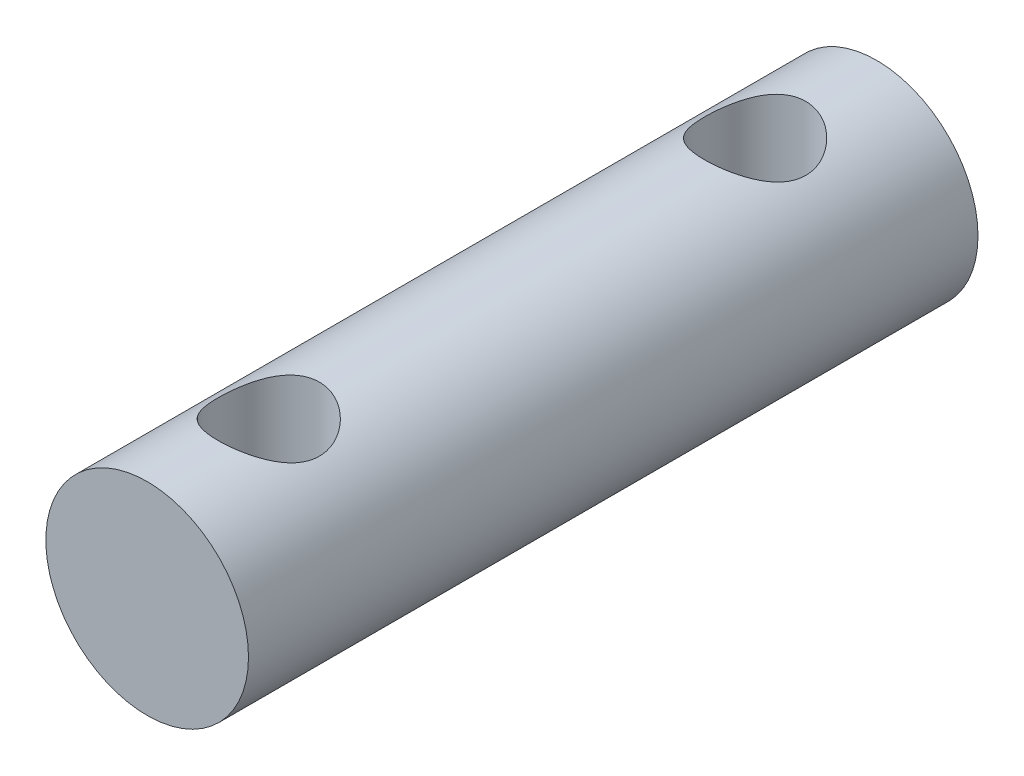
ISO-10303-21;
HEADER;
FILE_DESCRIPTION(('STEP AP214'),'2;1');
FILE_NAME('part.step','',(''),(''),'','','');
FILE_SCHEMA(('AUTOMOTIVE_DESIGN { 1 0 10303 214 1 1 1 1 }'));
ENDSEC;
DATA;
#1=APPLICATION_CONTEXT('core data for automotive mechanical design processes');
#2=APPLICATION_PROTOCOL_DEFINITION('international standard','automotive_design',2000,#1);
#3=PRODUCT_CONTEXT('',#1,'mechanical');
#4=PRODUCT('Part','Part','',(#3));
#5=PRODUCT_RELATED_PRODUCT_CATEGORY('part','',(#4));
#6=PRODUCT_DEFINITION_FORMATION('','',#4);
#7=PRODUCT_DEFINITION_CONTEXT('part definition',#1,'design');
#8=PRODUCT_DEFINITION('design','',#6,#7);
#9=PRODUCT_DEFINITION_SHAPE('','',#8);
#10=(LENGTH_UNIT() NAMED_UNIT(*) SI_UNIT(.MILLI.,.METRE.));
#11=(NAMED_UNIT(*) PLANE_ANGLE_UNIT() SI_UNIT($,.RADIAN.));
#12=(NAMED_UNIT(*) SI_UNIT($,.STERADIAN.) SOLID_ANGLE_UNIT());
#13=UNCERTAINTY_MEASURE_WITH_UNIT(LENGTH_MEASURE(1.E-05),#10,'distance_accuracy_value','');
#14=(GEOMETRIC_REPRESENTATION_CONTEXT(3) GLOBAL_UNCERTAINTY_ASSIGNED_CONTEXT((#13)) GLOBAL_UNIT_ASSIGNED_CONTEXT((#10,
#11,#12)) REPRESENTATION_CONTEXT('',''));
#15=CARTESIAN_POINT('',(0.,0.,0.));
#16=DIRECTION('',(0.,0.,1.));
#17=DIRECTION('',(1.,0.,0.));
#18=AXIS2_PLACEMENT_3D('',#15,#16,#17);
#19=CARTESIAN_POINT('',(0.,0.,18.));
#20=DIRECTION('',(0.,0.,-1.));
#21=DIRECTION('',(-1.,0.,0.));
#22=AXIS2_PLACEMENT_3D('',#19,#20,#21);
#23=CYLINDRICAL_SURFACE('',#22,2.5);
#24=CARTESIAN_POINT('',(0.,-2.5,4.25));
#25=CARTESIAN_POINT('',(0.0657149536912331,-2.49999641755188,4.24999587210062));
#26=CARTESIAN_POINT('',(0.131508249622541,-2.49738113774397,4.24478740859791));
#27=CARTESIAN_POINT('',(0.261150294085531,-2.48717695046745,4.22418389957385));
#28=CARTESIAN_POINT('',(0.32499510839188,-2.47957859786229,4.20876950875294));
#29=CARTESIAN_POINT('',(0.448666931100718,-2.46020349254139,4.16850773922901));
#30=CARTESIAN_POINT('',(0.508508503673975,-2.448442989719,4.14369701968999));
#31=CARTESIAN_POINT('',(0.623090771008206,-2.42182220644723,4.08553672329382));
#32=CARTESIAN_POINT('',(0.677831867487562,-2.40696217041912,4.05218781968893));
#33=CARTESIAN_POINT('',(0.784384772202399,-2.37445322822571,3.97560343814338));
#34=CARTESIAN_POINT('',(0.83581901390264,-2.3566899890942,3.93189190095045));
#35=CARTESIAN_POINT('',(0.930974306083722,-2.3207496280843,3.83684815094121));
#36=CARTESIAN_POINT('',(0.974689478883458,-2.30257220261294,3.78551018528445));
#37=CARTESIAN_POINT('',(1.05656500056285,-2.26623688996684,3.67189581309577));
#38=CARTESIAN_POINT('',(1.09403166943955,-2.24818983712665,3.60907987706761));
#39=CARTESIAN_POINT('',(1.15771028361337,-2.21607473465401,3.47704083001723));
#40=CARTESIAN_POINT('',(1.18393026870792,-2.20200384508737,3.40782233909656));
#41=CARTESIAN_POINT('',(1.22266555273574,-2.1807233379726,3.2691686182226));
#42=CARTESIAN_POINT('',(1.23590732135055,-2.17315339479642,3.19999443491576));
#43=CARTESIAN_POINT('',(1.25053374163606,-2.16477362435659,3.06002645277565));
#44=CARTESIAN_POINT('',(1.25193011046634,-2.1639571167911,2.98923432391106));
#45=CARTESIAN_POINT('',(1.24335910896537,-2.1688866282156,2.85714246960579));
#46=CARTESIAN_POINT('',(1.23473069942103,-2.17385954577517,2.79571996097119));
#47=CARTESIAN_POINT('',(1.20867481132117,-2.18845285917313,2.6753476132837));
#48=CARTESIAN_POINT('',(1.19124452987206,-2.1980747353972,2.61639856836836));
#49=CARTESIAN_POINT('',(1.1477622254825,-2.22109345515926,2.50096358429293));
#50=CARTESIAN_POINT('',(1.12151883389499,-2.23457300829998,2.44456700151776));
#51=CARTESIAN_POINT('',(1.061302109585,-2.26379255351754,2.33670713426249));
#52=CARTESIAN_POINT('',(1.02732530476558,-2.27953355975238,2.28524608049989));
#53=CARTESIAN_POINT('',(0.947582568640986,-2.31391447379107,2.18184843407097));
#54=CARTESIAN_POINT('',(0.900868072961602,-2.33266887795933,2.1306789080298));
#55=CARTESIAN_POINT('',(0.799444473426717,-2.36934529125509,2.03658072676137));
#56=CARTESIAN_POINT('',(0.744731570717857,-2.38726689948501,1.99365600995765));
#57=CARTESIAN_POINT('',(0.625645632289811,-2.42127484103705,1.91539292371284));
#58=CARTESIAN_POINT('',(0.560941989499261,-2.43723730202509,1.88049940944282));
#59=CARTESIAN_POINT('',(0.425582769360996,-2.46447351401553,1.82237871369624));
#60=CARTESIAN_POINT('',(0.354931970331596,-2.47575098679441,1.79914226873104));
#61=CARTESIAN_POINT('',(0.215958114575877,-2.49155417176795,1.76690574535416));
#62=CARTESIAN_POINT('',(0.147926913185405,-2.49656172876639,1.75688595531653));
#63=CARTESIAN_POINT('',(0.0109744999366919,-2.50091266823877,1.74816908608189));
#64=CARTESIAN_POINT('',(-0.0579462748373768,-2.5002587340164,1.74946664295065));
#65=CARTESIAN_POINT('',(-0.189041214982492,-2.49363990316801,1.76275836052344));
#66=CARTESIAN_POINT('',(-0.251324260062442,-2.48809057110237,1.77391566591254));
#67=CARTESIAN_POINT('',(-0.373008615377396,-2.47277714143524,1.80529758986886));
#68=CARTESIAN_POINT('',(-0.432409607113746,-2.46301257917915,1.8255232080667));
#69=CARTESIAN_POINT('',(-0.548610760562082,-2.43980314267087,1.87499808304146));
#70=CARTESIAN_POINT('',(-0.605287996257692,-2.42626102212424,1.90448881264602));
#71=CARTESIAN_POINT('',(-0.713076702123651,-2.39679967896386,1.97138441955755));
#72=CARTESIAN_POINT('',(-0.764185787219103,-2.38087944457231,2.00879266824179));
#73=CARTESIAN_POINT('',(-0.864709611613317,-2.3463527667183,2.09470053166609));
#74=CARTESIAN_POINT('',(-0.913465097280799,-2.32763606060551,2.14392858556696));
#75=CARTESIAN_POINT('',(-1.00232040139155,-2.29077989504843,2.24990643908663));
#76=CARTESIAN_POINT('',(-1.04241423211355,-2.27264084226908,2.30666139852047));
#77=CARTESIAN_POINT('',(-1.11463489312212,-2.23813990282585,2.42955456775039));
#78=CARTESIAN_POINT('',(-1.1462818698483,-2.2219066207934,2.49601408276074));
#79=CARTESIAN_POINT('',(-1.19760353251725,-2.19467590460158,2.63438758461565));
#80=CARTESIAN_POINT('',(-1.21729364485946,-2.18367172800772,2.70629440812648));
#81=CARTESIAN_POINT('',(-1.2423271093121,-2.16951876260833,2.84613777857681));
#82=CARTESIAN_POINT('',(-1.24886624550108,-2.16571729325614,2.91379281678629));
#83=CARTESIAN_POINT('',(-1.25086144297598,-2.16456693307719,3.04930883396341));
#84=CARTESIAN_POINT('',(-1.2463223082805,-2.16721524534441,3.11716971092429));
#85=CARTESIAN_POINT('',(-1.22740765699033,-2.17797327562531,3.24435437691502));
#86=CARTESIAN_POINT('',(-1.2140103929285,-2.18553868102992,3.3038755876805));
#87=CARTESIAN_POINT('',(-1.17896919778081,-2.20463770234897,3.41976014928088));
#88=CARTESIAN_POINT('',(-1.15732261394976,-2.21617259462094,3.47612247761496));
#89=CARTESIAN_POINT('',(-1.10476968162585,-2.2428566295566,3.58828106373326));
#90=CARTESIAN_POINT('',(-1.07333892227057,-2.25819652995238,3.64378487728713));
#91=CARTESIAN_POINT('',(-1.00268871454579,-2.29044164543238,3.74909317022573));
#92=CARTESIAN_POINT('',(-0.96346521404831,-2.30734767243152,3.79889466314811));
#93=CARTESIAN_POINT('',(-0.872754158330802,-2.34327903949141,3.89767747794702));
#94=CARTESIAN_POINT('',(-0.820355528762714,-2.36231229139336,3.9458238779524));
#95=CARTESIAN_POINT('',(-0.70769350777535,-2.39847190318859,4.03282872927954));
#96=CARTESIAN_POINT('',(-0.647425904070982,-2.4155972326005,4.07168217428286));
#97=CARTESIAN_POINT('',(-0.519914496024934,-2.44622511981379,4.13904545345276));
#98=CARTESIAN_POINT('',(-0.452624379918268,-2.45970120703636,4.16748021176429));
#99=CARTESIAN_POINT('',(-0.313427626617739,-2.48126676704332,4.21226020989869));
#100=CARTESIAN_POINT('',(-0.241534749528958,-2.48937154216165,4.22863980853697));
#101=CARTESIAN_POINT('',(-0.14075243310423,-2.49619327387079,4.24237176384481));
#102=CARTESIAN_POINT('',(-0.112702349299373,-2.49761706674002,4.24522830107952));
#103=CARTESIAN_POINT('',(-0.056439664758947,-2.49952121222331,4.24904333189601));
#104=CARTESIAN_POINT('',(-0.0282270595592267,-2.50000153879704,4.250001773089));
#105=CARTESIAN_POINT('',(0.,-2.5,4.25));
#106=B_SPLINE_CURVE_WITH_KNOTS('',3,(#24,#25,#26,#27,#28,#29,#30,#31,#32,#33,#34,#35,#36,#37,
#38,#39,#40,#41,#42,#43,#44,#45,#46,#47,#48,#49,#50,#51,#52,#53,#54,#55,#56,#57,#58,#59,#60,#61,
#62,#63,#64,#65,#66,#67,#68,#69,#70,#71,#72,#73,#74,#75,#76,#77,#78,#79,#80,#81,#82,#83,#84,#85,
#86,#87,#88,#89,#90,#91,#92,#93,#94,#95,#96,#97,#98,#99,#100,#101,#102,#103,#104,#105),
.UNSPECIFIED.,.T.,.F.,(4,2,2,2,2,2,2,2,2,2,2,2,2,2,2,2,2,2,2,2,2,2,2,2,2,2,2,2,2,2,2,2,2,2,2,2,
2,2,2,2,4),(0.,0.197030321775366,0.394435187136497,0.591077694365373,0.78770470072696,
0.996227198397612,1.20490779706754,1.42977158038441,1.65447434872851,1.86572515175287,
2.07676696661276,2.26257140511651,2.44843504907098,2.63862800210609,2.82890651575277,
3.04331176667348,3.25781918248358,3.48228777768051,3.7065777114035,3.91229113089182,
4.11790705639345,4.30758633132653,4.49728652038664,4.69241070034873,4.88761813435424,
5.10199513305524,5.3165198576929,5.54143352699593,5.76605639925972,5.96911634372967,
6.17208824825007,6.35572412805228,6.53941910979598,6.73545570969518,6.93159451423697,
7.15156553440623,7.37165479220716,7.59330017078656,7.81431135781163,7.89894100172122,
7.98357298143559),.UNSPECIFIED.);
#107=CARTESIAN_POINT('',(0.,-2.5,4.25));
#108=VERTEX_POINT('',#107);
#109=EDGE_CURVE('E10',#108,#108,#106,.T.);
#110=ORIENTED_EDGE('',*,*,#109,.T.);
#111=EDGE_LOOP('',(#110));
#112=FACE_BOUND('',#111,.T.);
#113=CARTESIAN_POINT('',(0.,2.5,4.25));
#114=CARTESIAN_POINT('',(-0.0657149536912331,2.49999641755188,4.24999587210062));
#115=CARTESIAN_POINT('',(-0.131508249622541,2.49738113774397,4.24478740859791));
#116=CARTESIAN_POINT('',(-0.261150294085531,2.48717695046745,4.22418389957385));
#117=CARTESIAN_POINT('',(-0.32499510839188,2.47957859786229,4.20876950875294));
#118=CARTESIAN_POINT('',(-0.448666931100718,2.46020349254139,4.16850773922901));
#119=CARTESIAN_POINT('',(-0.508508503673975,2.448442989719,4.14369701968999));
#120=CARTESIAN_POINT('',(-0.623090771008206,2.42182220644723,4.08553672329382));
#121=CARTESIAN_POINT('',(-0.677831867487562,2.40696217041912,4.05218781968893));
#122=CARTESIAN_POINT('',(-0.784384772202399,2.37445322822571,3.97560343814338));
#123=CARTESIAN_POINT('',(-0.83581901390264,2.3566899890942,3.93189190095045));
#124=CARTESIAN_POINT('',(-0.930974306083722,2.3207496280843,3.83684815094121));
#125=CARTESIAN_POINT('',(-0.974689478883458,2.30257220261294,3.78551018528445));
#126=CARTESIAN_POINT('',(-1.05656500056285,2.26623688996684,3.67189581309577));
#127=CARTESIAN_POINT('',(-1.09403166943955,2.24818983712665,3.60907987706761));
#128=CARTESIAN_POINT('',(-1.15771028361337,2.21607473465401,3.47704083001723));
#129=CARTESIAN_POINT('',(-1.18393026870792,2.20200384508737,3.40782233909656));
#130=CARTESIAN_POINT('',(-1.22266555273574,2.1807233379726,3.2691686182226));
#131=CARTESIAN_POINT('',(-1.23590732135055,2.17315339479642,3.19999443491576));
#132=CARTESIAN_POINT('',(-1.25053374163606,2.16477362435659,3.06002645277565));
#133=CARTESIAN_POINT('',(-1.25193011046634,2.1639571167911,2.98923432391106));
#134=CARTESIAN_POINT('',(-1.24335910896537,2.1688866282156,2.85714246960579));
#135=CARTESIAN_POINT('',(-1.23473069942103,2.17385954577517,2.79571996097119));
#136=CARTESIAN_POINT('',(-1.20867481132117,2.18845285917313,2.6753476132837));
#137=CARTESIAN_POINT('',(-1.19124452987206,2.1980747353972,2.61639856836836));
#138=CARTESIAN_POINT('',(-1.1477622254825,2.22109345515926,2.50096358429293));
#139=CARTESIAN_POINT('',(-1.12151883389499,2.23457300829998,2.44456700151776));
#140=CARTESIAN_POINT('',(-1.061302109585,2.26379255351754,2.33670713426249));
#141=CARTESIAN_POINT('',(-1.02732530476558,2.27953355975238,2.28524608049989));
#142=CARTESIAN_POINT('',(-0.947582568640986,2.31391447379107,2.18184843407097));
#143=CARTESIAN_POINT('',(-0.900868072961602,2.33266887795933,2.1306789080298));
#144=CARTESIAN_POINT('',(-0.799444473426717,2.36934529125509,2.03658072676137));
#145=CARTESIAN_POINT('',(-0.744731570717857,2.38726689948501,1.99365600995765));
#146=CARTESIAN_POINT('',(-0.625645632289811,2.42127484103705,1.91539292371284));
#147=CARTESIAN_POINT('',(-0.560941989499261,2.43723730202509,1.88049940944282));
#148=CARTESIAN_POINT('',(-0.425582769360996,2.46447351401553,1.82237871369624));
#149=CARTESIAN_POINT('',(-0.354931970331596,2.47575098679441,1.79914226873104));
#150=CARTESIAN_POINT('',(-0.215958114575877,2.49155417176795,1.76690574535416));
#151=CARTESIAN_POINT('',(-0.147926913185405,2.49656172876639,1.75688595531653));
#152=CARTESIAN_POINT('',(-0.0109744999366919,2.50091266823877,1.74816908608189));
#153=CARTESIAN_POINT('',(0.0579462748373768,2.5002587340164,1.74946664295065));
#154=CARTESIAN_POINT('',(0.189041214982492,2.49363990316801,1.76275836052344));
#155=CARTESIAN_POINT('',(0.251324260062442,2.48809057110237,1.77391566591254));
#156=CARTESIAN_POINT('',(0.373008615377396,2.47277714143524,1.80529758986886));
#157=CARTESIAN_POINT('',(0.432409607113746,2.46301257917915,1.8255232080667));
#158=CARTESIAN_POINT('',(0.548610760562082,2.43980314267087,1.87499808304146));
#159=CARTESIAN_POINT('',(0.605287996257692,2.42626102212424,1.90448881264602));
#160=CARTESIAN_POINT('',(0.713076702123651,2.39679967896386,1.97138441955755));
#161=CARTESIAN_POINT('',(0.764185787219103,2.38087944457231,2.00879266824179));
#162=CARTESIAN_POINT('',(0.864709611613317,2.3463527667183,2.09470053166609));
#163=CARTESIAN_POINT('',(0.913465097280799,2.32763606060551,2.14392858556696));
#164=CARTESIAN_POINT('',(1.00232040139155,2.29077989504843,2.24990643908663));
#165=CARTESIAN_POINT('',(1.04241423211355,2.27264084226908,2.30666139852047));
#166=CARTESIAN_POINT('',(1.11463489312212,2.23813990282585,2.42955456775039));
#167=CARTESIAN_POINT('',(1.1462818698483,2.2219066207934,2.49601408276074));
#168=CARTESIAN_POINT('',(1.19760353251725,2.19467590460158,2.63438758461565));
#169=CARTESIAN_POINT('',(1.21729364485946,2.18367172800772,2.70629440812648));
#170=CARTESIAN_POINT('',(1.2423271093121,2.16951876260833,2.84613777857681));
#171=CARTESIAN_POINT('',(1.24886624550108,2.16571729325614,2.91379281678629));
#172=CARTESIAN_POINT('',(1.25086144297598,2.16456693307719,3.04930883396341));
#173=CARTESIAN_POINT('',(1.2463223082805,2.16721524534441,3.11716971092429));
#174=CARTESIAN_POINT('',(1.22740765699033,2.17797327562531,3.24435437691502));
#175=CARTESIAN_POINT('',(1.2140103929285,2.18553868102992,3.3038755876805));
#176=CARTESIAN_POINT('',(1.17896919778081,2.20463770234897,3.41976014928088));
#177=CARTESIAN_POINT('',(1.15732261394976,2.21617259462094,3.47612247761496));
#178=CARTESIAN_POINT('',(1.10476968162585,2.2428566295566,3.58828106373326));
#179=CARTESIAN_POINT('',(1.07333892227057,2.25819652995238,3.64378487728713));
#180=CARTESIAN_POINT('',(1.00268871454579,2.29044164543238,3.74909317022573));
#181=CARTESIAN_POINT('',(0.96346521404831,2.30734767243152,3.79889466314811));
#182=CARTESIAN_POINT('',(0.872754158330802,2.34327903949141,3.89767747794702));
#183=CARTESIAN_POINT('',(0.820355528762714,2.36231229139336,3.9458238779524));
#184=CARTESIAN_POINT('',(0.70769350777535,2.39847190318859,4.03282872927954));
#185=CARTESIAN_POINT('',(0.647425904070982,2.4155972326005,4.07168217428286));
#186=CARTESIAN_POINT('',(0.519914496024934,2.44622511981379,4.13904545345276));
#187=CARTESIAN_POINT('',(0.452624379918268,2.45970120703636,4.16748021176429));
#188=CARTESIAN_POINT('',(0.313427626617739,2.48126676704332,4.21226020989869));
#189=CARTESIAN_POINT('',(0.241534749528958,2.48937154216165,4.22863980853697));
#190=CARTESIAN_POINT('',(0.14075243310423,2.49619327387079,4.24237176384481));
#191=CARTESIAN_POINT('',(0.112702349299373,2.49761706674002,4.24522830107952));
#192=CARTESIAN_POINT('',(0.056439664758947,2.49952121222331,4.24904333189601));
#193=CARTESIAN_POINT('',(0.0282270595592267,2.50000153879704,4.250001773089));
#194=CARTESIAN_POINT('',(0.,2.5,4.25));
#195=B_SPLINE_CURVE_WITH_KNOTS('',3,(#113,#114,#115,#116,#117,#118,#119,#120,#121,#122,#123,
#124,#125,#126,#127,#128,#129,#130,#131,#132,#133,#134,#135,#136,#137,#138,#139,#140,#141,#142,
#143,#144,#145,#146,#147,#148,#149,#150,#151,#152,#153,#154,#155,#156,#157,#158,#159,#160,#161,
#162,#163,#164,#165,#166,#167,#168,#169,#170,#171,#172,#173,#174,#175,#176,#177,#178,#179,#180,
#181,#182,#183,#184,#185,#186,#187,#188,#189,#190,#191,#192,#193,#194),.UNSPECIFIED.,.T.,.F.,(4,
2,2,2,2,2,2,2,2,2,2,2,2,2,2,2,2,2,2,2,2,2,2,2,2,2,2,2,2,2,2,2,2,2,2,2,2,2,2,2,4),(0.,
0.197030321775366,0.394435187136497,0.591077694365373,0.78770470072696,0.996227198397612,
1.20490779706754,1.42977158038441,1.65447434872851,1.86572515175287,2.07676696661276,
2.26257140511651,2.44843504907098,2.63862800210609,2.82890651575277,3.04331176667348,
3.25781918248358,3.48228777768051,3.7065777114035,3.91229113089182,4.11790705639345,
4.30758633132653,4.49728652038664,4.69241070034873,4.88761813435424,5.10199513305524,
5.3165198576929,5.54143352699593,5.76605639925972,5.96911634372967,6.17208824825007,
6.35572412805228,6.53941910979598,6.73545570969518,6.93159451423697,7.15156553440623,
7.37165479220716,7.59330017078656,7.81431135781163,7.89894100172122,7.98357298143559),.UNSPECIFIED.);
#196=CARTESIAN_POINT('',(0.,2.5,4.25));
#197=VERTEX_POINT('',#196);
#198=EDGE_CURVE('E55',#197,#197,#195,.T.);
#199=ORIENTED_EDGE('',*,*,#198,.T.);
#200=EDGE_LOOP('',(#199));
#201=FACE_BOUND('',#200,.T.);
#202=CARTESIAN_POINT('',(0.,-2.5,16.25));
#203=CARTESIAN_POINT('',(0.0657149536912331,-2.49999641755188,16.2499958721006));
#204=CARTESIAN_POINT('',(0.131508249622541,-2.49738113774397,16.2447874085979));
#205=CARTESIAN_POINT('',(0.261150294085531,-2.48717695046745,16.2241838995739));
#206=CARTESIAN_POINT('',(0.324995108391879,-2.47957859786229,16.2087695087529));
#207=CARTESIAN_POINT('',(0.448666931100718,-2.46020349254139,16.168507739229));
#208=CARTESIAN_POINT('',(0.508508503673975,-2.448442989719,16.14369701969));
#209=CARTESIAN_POINT('',(0.623090771008206,-2.42182220644723,16.0855367232938));
#210=CARTESIAN_POINT('',(0.677831867487562,-2.40696217041912,16.0521878196889));
#211=CARTESIAN_POINT('',(0.784384772202398,-2.37445322822571,15.9756034381434));
#212=CARTESIAN_POINT('',(0.835819013902639,-2.3566899890942,15.9318919009504));
#213=CARTESIAN_POINT('',(0.930974306083721,-2.3207496280843,15.8368481509412));
#214=CARTESIAN_POINT('',(0.974689478883458,-2.30257220261294,15.7855101852844));
#215=CARTESIAN_POINT('',(1.05656500056285,-2.26623688996684,15.6718958130958));
#216=CARTESIAN_POINT('',(1.09403166943955,-2.24818983712665,15.6090798770676));
#217=CARTESIAN_POINT('',(1.15771028361337,-2.21607473465401,15.4770408300172));
#218=CARTESIAN_POINT('',(1.18393026870792,-2.20200384508737,15.4078223390966));
#219=CARTESIAN_POINT('',(1.22266555273574,-2.1807233379726,15.2691686182226));
#220=CARTESIAN_POINT('',(1.23590732135055,-2.17315339479642,15.1999944349158));
#221=CARTESIAN_POINT('',(1.25053374163606,-2.16477362435659,15.0600264527757));
#222=CARTESIAN_POINT('',(1.25193011046634,-2.1639571167911,14.9892343239111));
#223=CARTESIAN_POINT('',(1.24335910896537,-2.1688866282156,14.8571424696058));
#224=CARTESIAN_POINT('',(1.23473069942103,-2.17385954577517,14.7957199609712));
#225=CARTESIAN_POINT('',(1.20867481132117,-2.18845285917313,14.6753476132837));
#226=CARTESIAN_POINT('',(1.19124452987207,-2.1980747353972,14.6163985683684));
#227=CARTESIAN_POINT('',(1.1477622254825,-2.22109345515926,14.5009635842929));
#228=CARTESIAN_POINT('',(1.12151883389499,-2.23457300829998,14.4445670015178));
#229=CARTESIAN_POINT('',(1.061302109585,-2.26379255351754,14.3367071342625));
#230=CARTESIAN_POINT('',(1.02732530476558,-2.27953355975238,14.2852460804999));
#231=CARTESIAN_POINT('',(0.947582568640985,-2.31391447379107,14.181848434071));
#232=CARTESIAN_POINT('',(0.900868072961601,-2.33266887795933,14.1306789080298));
#233=CARTESIAN_POINT('',(0.799444473426715,-2.36934529125509,14.0365807267614));
#234=CARTESIAN_POINT('',(0.744731570717856,-2.38726689948501,13.9936560099576));
#235=CARTESIAN_POINT('',(0.62564563228981,-2.42127484103705,13.9153929237128));
#236=CARTESIAN_POINT('',(0.56094198949926,-2.43723730202509,13.8804994094428));
#237=CARTESIAN_POINT('',(0.425582769360995,-2.46447351401553,13.8223787136962));
#238=CARTESIAN_POINT('',(0.354931970331595,-2.47575098679441,13.799142268731));
#239=CARTESIAN_POINT('',(0.215958114575876,-2.49155417176795,13.7669057453542));
#240=CARTESIAN_POINT('',(0.147926913185404,-2.49656172876639,13.7568859553165));
#241=CARTESIAN_POINT('',(0.0109744999366912,-2.50091266823877,13.7481690860819));
#242=CARTESIAN_POINT('',(-0.0579462748373774,-2.5002587340164,13.7494666429507));
#243=CARTESIAN_POINT('',(-0.189041214982492,-2.49363990316801,13.7627583605234));
#244=CARTESIAN_POINT('',(-0.251324260062442,-2.48809057110237,13.7739156659125));
#245=CARTESIAN_POINT('',(-0.373008615377396,-2.47277714143524,13.8052975898689));
#246=CARTESIAN_POINT('',(-0.432409607113746,-2.46301257917915,13.8255232080667));
#247=CARTESIAN_POINT('',(-0.548610760562082,-2.43980314267087,13.8749980830415));
#248=CARTESIAN_POINT('',(-0.605287996257693,-2.42626102212424,13.904488812646));
#249=CARTESIAN_POINT('',(-0.713076702123652,-2.39679967896386,13.9713844195576));
#250=CARTESIAN_POINT('',(-0.764185787219103,-2.38087944457231,14.0087926682418));
#251=CARTESIAN_POINT('',(-0.864709611613317,-2.3463527667183,14.0947005316661));
#252=CARTESIAN_POINT('',(-0.913465097280799,-2.32763606060551,14.143928585567));
#253=CARTESIAN_POINT('',(-1.00232040139155,-2.29077989504843,14.2499064390866));
#254=CARTESIAN_POINT('',(-1.04241423211355,-2.27264084226908,14.3066613985205));
#255=CARTESIAN_POINT('',(-1.11463489312212,-2.23813990282585,14.4295545677504));
#256=CARTESIAN_POINT('',(-1.1462818698483,-2.2219066207934,14.4960140827607));
#257=CARTESIAN_POINT('',(-1.19760353251725,-2.19467590460158,14.6343875846157));
#258=CARTESIAN_POINT('',(-1.21729364485946,-2.18367172800772,14.7062944081265));
#259=CARTESIAN_POINT('',(-1.2423271093121,-2.16951876260833,14.8461377785768));
#260=CARTESIAN_POINT('',(-1.24886624550108,-2.16571729325614,14.9137928167863));
#261=CARTESIAN_POINT('',(-1.25086144297598,-2.16456693307719,15.0493088339634));
#262=CARTESIAN_POINT('',(-1.2463223082805,-2.16721524534441,15.1171697109243));
#263=CARTESIAN_POINT('',(-1.22740765699033,-2.17797327562531,15.244354376915));
#264=CARTESIAN_POINT('',(-1.2140103929285,-2.18553868102992,15.3038755876805));
#265=CARTESIAN_POINT('',(-1.17896919778081,-2.20463770234897,15.4197601492809));
#266=CARTESIAN_POINT('',(-1.15732261394976,-2.21617259462094,15.476122477615));
#267=CARTESIAN_POINT('',(-1.10476968162585,-2.2428566295566,15.5882810637333));
#268=CARTESIAN_POINT('',(-1.07333892227057,-2.25819652995238,15.6437848772871));
#269=CARTESIAN_POINT('',(-1.00268871454579,-2.29044164543238,15.7490931702257));
#270=CARTESIAN_POINT('',(-0.96346521404831,-2.30734767243152,15.7988946631481));
#271=CARTESIAN_POINT('',(-0.8727541583308,-2.34327903949141,15.897677477947));
#272=CARTESIAN_POINT('',(-0.820355528762713,-2.36231229139336,15.9458238779524));
#273=CARTESIAN_POINT('',(-0.70769350777535,-2.39847190318859,16.0328287292795));
#274=CARTESIAN_POINT('',(-0.647425904070982,-2.4155972326005,16.0716821742829));
#275=CARTESIAN_POINT('',(-0.519914496024934,-2.44622511981379,16.1390454534528));
#276=CARTESIAN_POINT('',(-0.452624379918268,-2.45970120703636,16.1674802117643));
#277=CARTESIAN_POINT('',(-0.313427626617739,-2.48126676704332,16.2122602098987));
#278=CARTESIAN_POINT('',(-0.241534749528958,-2.48937154216165,16.228639808537));
#279=CARTESIAN_POINT('',(-0.14075243310423,-2.49619327387079,16.2423717638448));
#280=CARTESIAN_POINT('',(-0.112702349299374,-2.49761706674002,16.2452283010795));
#281=CARTESIAN_POINT('',(-0.0564396647589473,-2.49952121222331,16.249043331896));
#282=CARTESIAN_POINT('',(-0.0282270595592268,-2.50000153879704,16.250001773089));
#283=CARTESIAN_POINT('',(0.,-2.5,16.25));
#284=B_SPLINE_CURVE_WITH_KNOTS('',3,(#202,#203,#204,#205,#206,#207,#208,#209,#210,#211,#212,
#213,#214,#215,#216,#217,#218,#219,#220,#221,#222,#223,#224,#225,#226,#227,#228,#229,#230,#231,
#232,#233,#234,#235,#236,#237,#238,#239,#240,#241,#242,#243,#244,#245,#246,#247,#248,#249,#250,
#251,#252,#253,#254,#255,#256,#257,#258,#259,#260,#261,#262,#263,#264,#265,#266,#267,#268,#269,
#270,#271,#272,#273,#274,#275,#276,#277,#278,#279,#280,#281,#282,#283),.UNSPECIFIED.,.T.,.F.,(4,
2,2,2,2,2,2,2,2,2,2,2,2,2,2,2,2,2,2,2,2,2,2,2,2,2,2,2,2,2,2,2,2,2,2,2,2,2,2,2,4),(0.,
0.197030321775366,0.394435187136497,0.591077694365372,0.787704700726959,0.99622719839761,
1.20490779706754,1.42977158038441,1.65447434872851,1.86572515175287,2.07676696661275,
2.2625714051165,2.44843504907098,2.63862800210609,2.82890651575277,3.04331176667348,
3.25781918248358,3.48228777768051,3.7065777114035,3.91229113089182,4.11790705639345,
4.30758633132652,4.49728652038664,4.69241070034873,4.88761813435424,5.10199513305524,
5.3165198576929,5.54143352699592,5.76605639925972,5.96911634372967,6.17208824825007,
6.35572412805228,6.53941910979598,6.73545570969518,6.93159451423697,7.15156553440623,
7.37165479220716,7.59330017078656,7.81431135781163,7.89894100172122,7.98357298143558),.UNSPECIFIED.);
#285=CARTESIAN_POINT('',(0.,-2.5,16.25));
#286=VERTEX_POINT('',#285);
#287=EDGE_CURVE('E60',#286,#286,#284,.T.);
#288=ORIENTED_EDGE('',*,*,#287,.T.);
#289=EDGE_LOOP('',(#288));
#290=FACE_BOUND('',#289,.T.);
#291=CARTESIAN_POINT('',(0.,2.5,16.25));
#292=CARTESIAN_POINT('',(-0.0657149536912331,2.49999641755188,16.2499958721006));
#293=CARTESIAN_POINT('',(-0.131508249622541,2.49738113774397,16.2447874085979));
#294=CARTESIAN_POINT('',(-0.261150294085531,2.48717695046745,16.2241838995739));
#295=CARTESIAN_POINT('',(-0.324995108391879,2.47957859786229,16.2087695087529));
#296=CARTESIAN_POINT('',(-0.448666931100718,2.46020349254139,16.168507739229));
#297=CARTESIAN_POINT('',(-0.508508503673975,2.448442989719,16.14369701969));
#298=CARTESIAN_POINT('',(-0.623090771008206,2.42182220644723,16.0855367232938));
#299=CARTESIAN_POINT('',(-0.677831867487562,2.40696217041912,16.0521878196889));
#300=CARTESIAN_POINT('',(-0.784384772202398,2.37445322822571,15.9756034381434));
#301=CARTESIAN_POINT('',(-0.835819013902639,2.3566899890942,15.9318919009504));
#302=CARTESIAN_POINT('',(-0.930974306083721,2.3207496280843,15.8368481509412));
#303=CARTESIAN_POINT('',(-0.974689478883458,2.30257220261294,15.7855101852844));
#304=CARTESIAN_POINT('',(-1.05656500056285,2.26623688996684,15.6718958130958));
#305=CARTESIAN_POINT('',(-1.09403166943955,2.24818983712665,15.6090798770676));
#306=CARTESIAN_POINT('',(-1.15771028361337,2.21607473465401,15.4770408300172));
#307=CARTESIAN_POINT('',(-1.18393026870792,2.20200384508737,15.4078223390966));
#308=CARTESIAN_POINT('',(-1.22266555273574,2.1807233379726,15.2691686182226));
#309=CARTESIAN_POINT('',(-1.23590732135055,2.17315339479642,15.1999944349158));
#310=CARTESIAN_POINT('',(-1.25053374163606,2.16477362435659,15.0600264527757));
#311=CARTESIAN_POINT('',(-1.25193011046634,2.1639571167911,14.9892343239111));
#312=CARTESIAN_POINT('',(-1.24335910896537,2.1688866282156,14.8571424696058));
#313=CARTESIAN_POINT('',(-1.23473069942103,2.17385954577517,14.7957199609712));
#314=CARTESIAN_POINT('',(-1.20867481132117,2.18845285917313,14.6753476132837));
#315=CARTESIAN_POINT('',(-1.19124452987207,2.1980747353972,14.6163985683684));
#316=CARTESIAN_POINT('',(-1.1477622254825,2.22109345515926,14.5009635842929));
#317=CARTESIAN_POINT('',(-1.12151883389499,2.23457300829998,14.4445670015178));
#318=CARTESIAN_POINT('',(-1.061302109585,2.26379255351754,14.3367071342625));
#319=CARTESIAN_POINT('',(-1.02732530476558,2.27953355975238,14.2852460804999));
#320=CARTESIAN_POINT('',(-0.947582568640985,2.31391447379107,14.181848434071));
#321=CARTESIAN_POINT('',(-0.900868072961601,2.33266887795933,14.1306789080298));
#322=CARTESIAN_POINT('',(-0.799444473426715,2.36934529125509,14.0365807267614));
#323=CARTESIAN_POINT('',(-0.744731570717856,2.38726689948501,13.9936560099576));
#324=CARTESIAN_POINT('',(-0.62564563228981,2.42127484103705,13.9153929237128));
#325=CARTESIAN_POINT('',(-0.56094198949926,2.43723730202509,13.8804994094428));
#326=CARTESIAN_POINT('',(-0.425582769360995,2.46447351401553,13.8223787136962));
#327=CARTESIAN_POINT('',(-0.354931970331595,2.47575098679441,13.799142268731));
#328=CARTESIAN_POINT('',(-0.215958114575876,2.49155417176795,13.7669057453542));
#329=CARTESIAN_POINT('',(-0.147926913185404,2.49656172876639,13.7568859553165));
#330=CARTESIAN_POINT('',(-0.0109744999366912,2.50091266823877,13.7481690860819));
#331=CARTESIAN_POINT('',(0.0579462748373774,2.5002587340164,13.7494666429507));
#332=CARTESIAN_POINT('',(0.189041214982492,2.49363990316801,13.7627583605234));
#333=CARTESIAN_POINT('',(0.251324260062442,2.48809057110237,13.7739156659125));
#334=CARTESIAN_POINT('',(0.373008615377396,2.47277714143524,13.8052975898689));
#335=CARTESIAN_POINT('',(0.432409607113746,2.46301257917915,13.8255232080667));
#336=CARTESIAN_POINT('',(0.548610760562082,2.43980314267087,13.8749980830415));
#337=CARTESIAN_POINT('',(0.605287996257693,2.42626102212424,13.904488812646));
#338=CARTESIAN_POINT('',(0.713076702123652,2.39679967896386,13.9713844195576));
#339=CARTESIAN_POINT('',(0.764185787219103,2.38087944457231,14.0087926682418));
#340=CARTESIAN_POINT('',(0.864709611613317,2.3463527667183,14.0947005316661));
#341=CARTESIAN_POINT('',(0.913465097280799,2.32763606060551,14.143928585567));
#342=CARTESIAN_POINT('',(1.00232040139155,2.29077989504843,14.2499064390866));
#343=CARTESIAN_POINT('',(1.04241423211355,2.27264084226908,14.3066613985205));
#344=CARTESIAN_POINT('',(1.11463489312212,2.23813990282585,14.4295545677504));
#345=CARTESIAN_POINT('',(1.1462818698483,2.2219066207934,14.4960140827607));
#346=CARTESIAN_POINT('',(1.19760353251725,2.19467590460158,14.6343875846157));
#347=CARTESIAN_POINT('',(1.21729364485946,2.18367172800772,14.7062944081265));
#348=CARTESIAN_POINT('',(1.2423271093121,2.16951876260833,14.8461377785768));
#349=CARTESIAN_POINT('',(1.24886624550108,2.16571729325614,14.9137928167863));
#350=CARTESIAN_POINT('',(1.25086144297598,2.16456693307719,15.0493088339634));
#351=CARTESIAN_POINT('',(1.2463223082805,2.16721524534441,15.1171697109243));
#352=CARTESIAN_POINT('',(1.22740765699033,2.17797327562531,15.244354376915));
#353=CARTESIAN_POINT('',(1.2140103929285,2.18553868102992,15.3038755876805));
#354=CARTESIAN_POINT('',(1.17896919778081,2.20463770234897,15.4197601492809));
#355=CARTESIAN_POINT('',(1.15732261394976,2.21617259462094,15.476122477615));
#356=CARTESIAN_POINT('',(1.10476968162585,2.2428566295566,15.5882810637333));
#357=CARTESIAN_POINT('',(1.07333892227057,2.25819652995238,15.6437848772871));
#358=CARTESIAN_POINT('',(1.00268871454579,2.29044164543238,15.7490931702257));
#359=CARTESIAN_POINT('',(0.96346521404831,2.30734767243152,15.7988946631481));
#360=CARTESIAN_POINT('',(0.8727541583308,2.34327903949141,15.897677477947));
#361=CARTESIAN_POINT('',(0.820355528762713,2.36231229139336,15.9458238779524));
#362=CARTESIAN_POINT('',(0.70769350777535,2.39847190318859,16.0328287292795));
#363=CARTESIAN_POINT('',(0.647425904070982,2.4155972326005,16.0716821742829));
#364=CARTESIAN_POINT('',(0.519914496024934,2.44622511981379,16.1390454534528));
#365=CARTESIAN_POINT('',(0.452624379918268,2.45970120703636,16.1674802117643));
#366=CARTESIAN_POINT('',(0.313427626617739,2.48126676704332,16.2122602098987));
#367=CARTESIAN_POINT('',(0.241534749528958,2.48937154216165,16.228639808537));
#368=CARTESIAN_POINT('',(0.14075243310423,2.49619327387079,16.2423717638448));
#369=CARTESIAN_POINT('',(0.112702349299374,2.49761706674002,16.2452283010795));
#370=CARTESIAN_POINT('',(0.0564396647589473,2.49952121222331,16.249043331896));
#371=CARTESIAN_POINT('',(0.0282270595592268,2.50000153879704,16.250001773089));
#372=CARTESIAN_POINT('',(0.,2.5,16.25));
#373=B_SPLINE_CURVE_WITH_KNOTS('',3,(#291,#292,#293,#294,#295,#296,#297,#298,#299,#300,#301,
#302,#303,#304,#305,#306,#307,#308,#309,#310,#311,#312,#313,#314,#315,#316,#317,#318,#319,#320,
#321,#322,#323,#324,#325,#326,#327,#328,#329,#330,#331,#332,#333,#334,#335,#336,#337,#338,#339,
#340,#341,#342,#343,#344,#345,#346,#347,#348,#349,#350,#351,#352,#353,#354,#355,#356,#357,#358,
#359,#360,#361,#362,#363,#364,#365,#366,#367,#368,#369,#370,#371,#372),.UNSPECIFIED.,.T.,.F.,(4,
2,2,2,2,2,2,2,2,2,2,2,2,2,2,2,2,2,2,2,2,2,2,2,2,2,2,2,2,2,2,2,2,2,2,2,2,2,2,2,4),(0.,
0.197030321775366,0.394435187136497,0.591077694365372,0.787704700726959,0.99622719839761,
1.20490779706754,1.42977158038441,1.65447434872851,1.86572515175287,2.07676696661275,
2.2625714051165,2.44843504907098,2.63862800210609,2.82890651575277,3.04331176667348,
3.25781918248358,3.48228777768051,3.7065777114035,3.91229113089182,4.11790705639345,
4.30758633132652,4.49728652038664,4.69241070034873,4.88761813435424,5.10199513305524,
5.3165198576929,5.54143352699592,5.76605639925972,5.96911634372967,6.17208824825007,
6.35572412805228,6.53941910979598,6.73545570969518,6.93159451423697,7.15156553440623,
7.37165479220716,7.59330017078656,7.81431135781163,7.89894100172122,7.98357298143558),.UNSPECIFIED.);
#374=CARTESIAN_POINT('',(0.,2.5,16.25));
#375=VERTEX_POINT('',#374);
#376=EDGE_CURVE('E65',#375,#375,#373,.T.);
#377=ORIENTED_EDGE('',*,*,#376,.T.);
#378=EDGE_LOOP('',(#377));
#379=FACE_BOUND('',#378,.T.);
#380=CARTESIAN_POINT('',(0.,0.,18.));
#381=DIRECTION('',(0.,0.,1.));
#382=DIRECTION('',(1.,0.,0.));
#383=AXIS2_PLACEMENT_3D('',#380,#381,#382);
#384=CIRCLE('',#383,2.5);
#385=CARTESIAN_POINT('',(2.5,0.,18.));
#386=VERTEX_POINT('',#385);
#387=EDGE_CURVE('E94',#386,#386,#384,.T.);
#388=ORIENTED_EDGE('',*,*,#387,.F.);
#389=EDGE_LOOP('',(#388));
#390=FACE_BOUND('',#389,.T.);
#391=CARTESIAN_POINT('',(0.,0.,0.));
#392=DIRECTION('',(0.,0.,1.));
#393=DIRECTION('',(1.,0.,0.));
#394=AXIS2_PLACEMENT_3D('',#391,#392,#393);
#395=CIRCLE('',#394,2.5);
#396=CARTESIAN_POINT('',(2.5,0.,0.));
#397=VERTEX_POINT('',#396);
#398=EDGE_CURVE('E95',#397,#397,#395,.T.);
#399=ORIENTED_EDGE('',*,*,#398,.T.);
#400=EDGE_LOOP('',(#399));
#401=FACE_BOUND('',#400,.T.);
#402=ADVANCED_FACE('F43',(#112,#201,#290,#379,#390,#401),#23,.T.);
#403=CARTESIAN_POINT('',(0.,0.,18.));
#404=DIRECTION('',(0.,0.,1.));
#405=DIRECTION('',(1.,0.,0.));
#406=AXIS2_PLACEMENT_3D('',#403,#404,#405);
#407=PLANE('',#406);
#408=ORIENTED_EDGE('',*,*,#387,.T.);
#409=EDGE_LOOP('',(#408));
#410=FACE_BOUND('',#409,.T.);
#411=ADVANCED_FACE('F86',(#410),#407,.T.);
#412=CARTESIAN_POINT('',(0.,0.,0.));
#413=DIRECTION('',(0.,0.,1.));
#414=DIRECTION('',(1.,0.,0.));
#415=AXIS2_PLACEMENT_3D('',#412,#413,#414);
#416=PLANE('',#415);
#417=ORIENTED_EDGE('',*,*,#398,.F.);
#418=EDGE_LOOP('',(#417));
#419=FACE_BOUND('',#418,.T.);
#420=ADVANCED_FACE('F84',(#419),#416,.F.);
#421=CARTESIAN_POINT('',(0.,-2.5,15.));
#422=DIRECTION('',(0.,1.,0.));
#423=DIRECTION('',(0.,0.,1.));
#424=AXIS2_PLACEMENT_3D('',#421,#422,#423);
#425=CYLINDRICAL_SURFACE('',#424,1.25);
#426=ORIENTED_EDGE('',*,*,#376,.F.);
#427=EDGE_LOOP('',(#426));
#428=FACE_BOUND('',#427,.T.);
#429=ORIENTED_EDGE('',*,*,#287,.F.);
#430=EDGE_LOOP('',(#429));
#431=FACE_BOUND('',#430,.T.);
#432=ADVANCED_FACE('F78',(#428,#431),#425,.F.);
#433=CARTESIAN_POINT('',(0.,-2.5,3.));
#434=DIRECTION('',(0.,1.,0.));
#435=DIRECTION('',(0.,0.,1.));
#436=AXIS2_PLACEMENT_3D('',#433,#434,#435);
#437=CYLINDRICAL_SURFACE('',#436,1.25);
#438=ORIENTED_EDGE('',*,*,#198,.F.);
#439=EDGE_LOOP('',(#438));
#440=FACE_BOUND('',#439,.T.);
#441=ORIENTED_EDGE('',*,*,#109,.F.);
#442=EDGE_LOOP('',(#441));
#443=FACE_BOUND('',#442,.T.);
#444=ADVANCED_FACE('F75',(#440,#443),#437,.F.);
#445=CLOSED_SHELL('',(#402,#411,#420,#432,#444));
#446=MANIFOLD_SOLID_BREP('B2',#445);
#447=ADVANCED_BREP_SHAPE_REPRESENTATION('',(#18,#446),#14);
#448=SHAPE_DEFINITION_REPRESENTATION(#9,#447);
ENDSEC;
END-ISO-10303-21;
